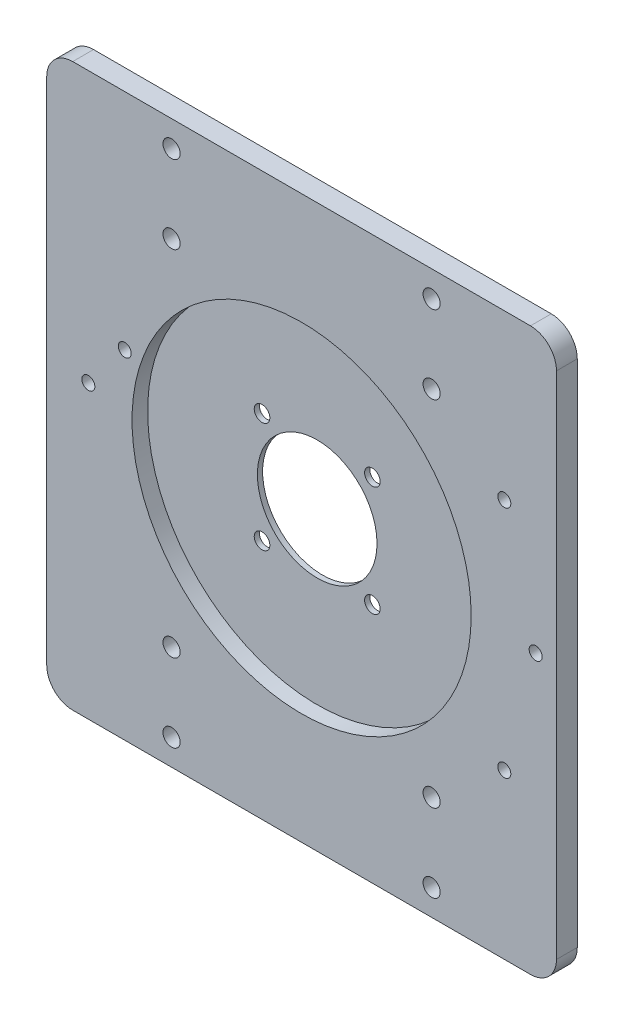
ISO-10303-21;
HEADER;
FILE_DESCRIPTION(('STEP AP214'),'2;1');
FILE_NAME('part.step','',(''),(''),'','','');
FILE_SCHEMA(('AUTOMOTIVE_DESIGN { 1 0 10303 214 1 1 1 1 }'));
ENDSEC;
DATA;
#1=APPLICATION_CONTEXT('core data for automotive mechanical design processes');
#2=APPLICATION_PROTOCOL_DEFINITION('international standard','automotive_design',2000,#1);
#3=PRODUCT_CONTEXT('',#1,'mechanical');
#4=PRODUCT('Part','Part','',(#3));
#5=PRODUCT_RELATED_PRODUCT_CATEGORY('part','',(#4));
#6=PRODUCT_DEFINITION_FORMATION('','',#4);
#7=PRODUCT_DEFINITION_CONTEXT('part definition',#1,'design');
#8=PRODUCT_DEFINITION('design','',#6,#7);
#9=PRODUCT_DEFINITION_SHAPE('','',#8);
#10=(LENGTH_UNIT() NAMED_UNIT(*) SI_UNIT(.MILLI.,.METRE.));
#11=(NAMED_UNIT(*) PLANE_ANGLE_UNIT() SI_UNIT($,.RADIAN.));
#12=(NAMED_UNIT(*) SI_UNIT($,.STERADIAN.) SOLID_ANGLE_UNIT());
#13=UNCERTAINTY_MEASURE_WITH_UNIT(LENGTH_MEASURE(1.E-05),#10,'distance_accuracy_value','');
#14=(GEOMETRIC_REPRESENTATION_CONTEXT(3) GLOBAL_UNCERTAINTY_ASSIGNED_CONTEXT((#13)) GLOBAL_UNIT_ASSIGNED_CONTEXT((#10,
#11,#12)) REPRESENTATION_CONTEXT('',''));
#15=CARTESIAN_POINT('',(0.,0.,0.));
#16=DIRECTION('',(0.,0.,1.));
#17=DIRECTION('',(1.,0.,0.));
#18=AXIS2_PLACEMENT_3D('',#15,#16,#17);
#19=CARTESIAN_POINT('',(0.,0.,-6.));
#20=DIRECTION('',(0.,0.,1.));
#21=DIRECTION('',(1.,0.,0.));
#22=AXIS2_PLACEMENT_3D('',#19,#20,#21);
#23=CYLINDRICAL_SURFACE('',#22,11.5);
#24=CARTESIAN_POINT('',(0.,0.,0.));
#25=DIRECTION('',(0.,0.,1.));
#26=DIRECTION('',(1.,0.,0.));
#27=AXIS2_PLACEMENT_3D('',#24,#25,#26);
#28=CIRCLE('',#27,11.5);
#29=CARTESIAN_POINT('',(11.5,0.,0.));
#30=VERTEX_POINT('',#29);
#31=EDGE_CURVE('E153',#30,#30,#28,.T.);
#32=ORIENTED_EDGE('',*,*,#31,.F.);
#33=EDGE_LOOP('',(#32));
#34=FACE_BOUND('',#33,.T.);
#35=CARTESIAN_POINT('',(0.,0.,1.));
#36=DIRECTION('',(0.,0.,1.));
#37=DIRECTION('',(1.,0.,0.));
#38=AXIS2_PLACEMENT_3D('',#35,#36,#37);
#39=CIRCLE('',#38,11.5);
#40=CARTESIAN_POINT('',(11.5,0.,1.));
#41=VERTEX_POINT('',#40);
#42=EDGE_CURVE('E163',#41,#41,#39,.F.);
#43=ORIENTED_EDGE('',*,*,#42,.F.);
#44=EDGE_LOOP('',(#43));
#45=FACE_BOUND('',#44,.T.);
#46=ADVANCED_FACE('F52',(#34,#45),#23,.F.);
#47=CARTESIAN_POINT('',(-49.,-54.,4.));
#48=DIRECTION('',(1.,0.,0.));
#49=DIRECTION('',(0.,0.,-1.));
#50=AXIS2_PLACEMENT_3D('',#47,#48,#49);
#51=PLANE('',#50);
#52=DIRECTION('',(0.,-1.,0.));
#53=VECTOR('',#52,1.);
#54=CARTESIAN_POINT('',(-49.,-54.,0.));
#55=LINE('',#54,#53);
#56=CARTESIAN_POINT('',(-49.,49.,0.));
#57=VERTEX_POINT('',#56);
#58=CARTESIAN_POINT('',(-49.,-49.,0.));
#59=VERTEX_POINT('',#58);
#60=EDGE_CURVE('E146',#57,#59,#55,.T.);
#61=ORIENTED_EDGE('',*,*,#60,.T.);
#62=DIRECTION('',(0.,0.,-1.));
#63=VECTOR('',#62,1.);
#64=CARTESIAN_POINT('',(-49.,-49.,4.));
#65=LINE('',#64,#63);
#66=CARTESIAN_POINT('',(-49.,-49.,4.));
#67=VERTEX_POINT('',#66);
#68=EDGE_CURVE('E124',#59,#67,#65,.F.);
#69=ORIENTED_EDGE('',*,*,#68,.T.);
#70=DIRECTION('',(0.,-1.,0.));
#71=VECTOR('',#70,1.);
#72=CARTESIAN_POINT('',(-49.,-54.,4.));
#73=LINE('',#72,#71);
#74=CARTESIAN_POINT('',(-49.,49.,4.));
#75=VERTEX_POINT('',#74);
#76=EDGE_CURVE('E159',#75,#67,#73,.T.);
#77=ORIENTED_EDGE('',*,*,#76,.F.);
#78=DIRECTION('',(0.,0.,-1.));
#79=VECTOR('',#78,1.);
#80=CARTESIAN_POINT('',(-49.,49.,4.));
#81=LINE('',#80,#79);
#82=EDGE_CURVE('E129',#75,#57,#81,.T.);
#83=ORIENTED_EDGE('',*,*,#82,.T.);
#84=EDGE_LOOP('',(#61,#69,#77,#83));
#85=FACE_BOUND('',#84,.T.);
#86=ADVANCED_FACE('F364',(#85),#51,.F.);
#87=CARTESIAN_POINT('',(49.,-54.,4.));
#88=DIRECTION('',(0.,1.,0.));
#89=DIRECTION('',(-1.,0.,0.));
#90=AXIS2_PLACEMENT_3D('',#87,#88,#89);
#91=PLANE('',#90);
#92=DIRECTION('',(1.,0.,0.));
#93=VECTOR('',#92,1.);
#94=CARTESIAN_POINT('',(49.,-54.,4.));
#95=LINE('',#94,#93);
#96=CARTESIAN_POINT('',(-44.,-54.,4.));
#97=VERTEX_POINT('',#96);
#98=CARTESIAN_POINT('',(44.,-54.,4.));
#99=VERTEX_POINT('',#98);
#100=EDGE_CURVE('E139',#97,#99,#95,.T.);
#101=ORIENTED_EDGE('',*,*,#100,.F.);
#102=DIRECTION('',(0.,0.,-1.));
#103=VECTOR('',#102,1.);
#104=CARTESIAN_POINT('',(-44.,-54.,4.));
#105=LINE('',#104,#103);
#106=CARTESIAN_POINT('',(-44.,-54.,0.));
#107=VERTEX_POINT('',#106);
#108=EDGE_CURVE('E123',#97,#107,#105,.T.);
#109=ORIENTED_EDGE('',*,*,#108,.T.);
#110=DIRECTION('',(1.,0.,0.));
#111=VECTOR('',#110,1.);
#112=CARTESIAN_POINT('',(49.,-54.,0.));
#113=LINE('',#112,#111);
#114=CARTESIAN_POINT('',(44.,-54.,0.));
#115=VERTEX_POINT('',#114);
#116=EDGE_CURVE('E136',#107,#115,#113,.T.);
#117=ORIENTED_EDGE('',*,*,#116,.T.);
#118=DIRECTION('',(0.,0.,-1.));
#119=VECTOR('',#118,1.);
#120=CARTESIAN_POINT('',(44.,-54.,4.));
#121=LINE('',#120,#119);
#122=EDGE_CURVE('E141',#115,#99,#121,.F.);
#123=ORIENTED_EDGE('',*,*,#122,.T.);
#124=EDGE_LOOP('',(#101,#109,#117,#123));
#125=FACE_BOUND('',#124,.T.);
#126=ADVANCED_FACE('F135',(#125),#91,.F.);
#127=CARTESIAN_POINT('',(49.,-54.,4.));
#128=DIRECTION('',(-1.,0.,0.));
#129=DIRECTION('',(0.,0.,1.));
#130=AXIS2_PLACEMENT_3D('',#127,#128,#129);
#131=PLANE('',#130);
#132=DIRECTION('',(0.,1.,0.));
#133=VECTOR('',#132,1.);
#134=CARTESIAN_POINT('',(49.,-54.,4.));
#135=LINE('',#134,#133);
#136=CARTESIAN_POINT('',(49.,-49.,4.));
#137=VERTEX_POINT('',#136);
#138=CARTESIAN_POINT('',(49.,49.,4.));
#139=VERTEX_POINT('',#138);
#140=EDGE_CURVE('E196',#137,#139,#135,.T.);
#141=ORIENTED_EDGE('',*,*,#140,.F.);
#142=DIRECTION('',(0.,0.,-1.));
#143=VECTOR('',#142,1.);
#144=CARTESIAN_POINT('',(49.,-49.,4.));
#145=LINE('',#144,#143);
#146=CARTESIAN_POINT('',(49.,-49.,0.));
#147=VERTEX_POINT('',#146);
#148=EDGE_CURVE('E188',#137,#147,#145,.T.);
#149=ORIENTED_EDGE('',*,*,#148,.T.);
#150=DIRECTION('',(0.,1.,0.));
#151=VECTOR('',#150,1.);
#152=CARTESIAN_POINT('',(49.,-54.,0.));
#153=LINE('',#152,#151);
#154=CARTESIAN_POINT('',(49.,49.,0.));
#155=VERTEX_POINT('',#154);
#156=EDGE_CURVE('E145',#147,#155,#153,.T.);
#157=ORIENTED_EDGE('',*,*,#156,.T.);
#158=DIRECTION('',(0.,0.,-1.));
#159=VECTOR('',#158,1.);
#160=CARTESIAN_POINT('',(49.,49.,4.));
#161=LINE('',#160,#159);
#162=EDGE_CURVE('E186',#155,#139,#161,.F.);
#163=ORIENTED_EDGE('',*,*,#162,.T.);
#164=EDGE_LOOP('',(#141,#149,#157,#163));
#165=FACE_BOUND('',#164,.T.);
#166=ADVANCED_FACE('F194',(#165),#131,.F.);
#167=CARTESIAN_POINT('',(49.,54.,4.));
#168=DIRECTION('',(0.,-1.,0.));
#169=DIRECTION('',(1.,0.,0.));
#170=AXIS2_PLACEMENT_3D('',#167,#168,#169);
#171=PLANE('',#170);
#172=DIRECTION('',(-1.,0.,0.));
#173=VECTOR('',#172,1.);
#174=CARTESIAN_POINT('',(49.,54.,4.));
#175=LINE('',#174,#173);
#176=CARTESIAN_POINT('',(44.,54.,4.));
#177=VERTEX_POINT('',#176);
#178=CARTESIAN_POINT('',(-44.,54.,4.));
#179=VERTEX_POINT('',#178);
#180=EDGE_CURVE('E168',#177,#179,#175,.T.);
#181=ORIENTED_EDGE('',*,*,#180,.F.);
#182=DIRECTION('',(0.,0.,-1.));
#183=VECTOR('',#182,1.);
#184=CARTESIAN_POINT('',(44.,54.,4.));
#185=LINE('',#184,#183);
#186=CARTESIAN_POINT('',(44.,54.,0.));
#187=VERTEX_POINT('',#186);
#188=EDGE_CURVE('E13',#177,#187,#185,.T.);
#189=ORIENTED_EDGE('',*,*,#188,.T.);
#190=DIRECTION('',(-1.,0.,0.));
#191=VECTOR('',#190,1.);
#192=CARTESIAN_POINT('',(49.,54.,0.));
#193=LINE('',#192,#191);
#194=CARTESIAN_POINT('',(-44.,54.,0.));
#195=VERTEX_POINT('',#194);
#196=EDGE_CURVE('E150',#187,#195,#193,.T.);
#197=ORIENTED_EDGE('',*,*,#196,.T.);
#198=DIRECTION('',(0.,0.,-1.));
#199=VECTOR('',#198,1.);
#200=CARTESIAN_POINT('',(-44.,54.,4.));
#201=LINE('',#200,#199);
#202=EDGE_CURVE('E61',#195,#179,#201,.F.);
#203=ORIENTED_EDGE('',*,*,#202,.T.);
#204=EDGE_LOOP('',(#181,#189,#197,#203));
#205=FACE_BOUND('',#204,.T.);
#206=ADVANCED_FACE('F203',(#205),#171,.F.);
#207=CARTESIAN_POINT('',(0.,0.,4.));
#208=DIRECTION('',(0.,0.,1.));
#209=DIRECTION('',(1.,0.,0.));
#210=AXIS2_PLACEMENT_3D('',#207,#208,#209);
#211=PLANE('',#210);
#212=CARTESIAN_POINT('',(38.9711431702997,22.5000000000001,4.));
#213=DIRECTION('',(0.,0.,1.));
#214=DIRECTION('',(1.,0.,0.));
#215=AXIS2_PLACEMENT_3D('',#212,#213,#214);
#216=CIRCLE('',#215,1.24999999999999);
#217=CARTESIAN_POINT('',(40.2211431702997,22.5000000000001,4.));
#218=VERTEX_POINT('',#217);
#219=EDGE_CURVE('E326',#218,#218,#216,.T.);
#220=ORIENTED_EDGE('',*,*,#219,.F.);
#221=EDGE_LOOP('',(#220));
#222=FACE_BOUND('',#221,.T.);
#223=CARTESIAN_POINT('',(45.,0.,4.));
#224=DIRECTION('',(0.,0.,1.));
#225=DIRECTION('',(1.,0.,0.));
#226=AXIS2_PLACEMENT_3D('',#223,#224,#225);
#227=CIRCLE('',#226,1.24999999999999);
#228=CARTESIAN_POINT('',(46.25,0.,4.));
#229=VERTEX_POINT('',#228);
#230=EDGE_CURVE('E320',#229,#229,#227,.T.);
#231=ORIENTED_EDGE('',*,*,#230,.F.);
#232=EDGE_LOOP('',(#231));
#233=FACE_BOUND('',#232,.T.);
#234=CARTESIAN_POINT('',(38.9711431702997,-22.5,4.));
#235=DIRECTION('',(0.,0.,1.));
#236=DIRECTION('',(1.,0.,0.));
#237=AXIS2_PLACEMENT_3D('',#234,#235,#236);
#238=CIRCLE('',#237,1.24999999999999);
#239=CARTESIAN_POINT('',(40.2211431702997,-22.5,4.));
#240=VERTEX_POINT('',#239);
#241=EDGE_CURVE('E314',#240,#240,#238,.T.);
#242=ORIENTED_EDGE('',*,*,#241,.F.);
#243=EDGE_LOOP('',(#242));
#244=FACE_BOUND('',#243,.T.);
#245=CARTESIAN_POINT('',(-41.0000000000006,2.00000000000001,4.));
#246=DIRECTION('',(0.,0.,1.));
#247=DIRECTION('',(1.,0.,0.));
#248=AXIS2_PLACEMENT_3D('',#245,#246,#247);
#249=CIRCLE('',#248,1.24999999999999);
#250=CARTESIAN_POINT('',(-39.7500000000007,2.00000000000001,4.));
#251=VERTEX_POINT('',#250);
#252=EDGE_CURVE('E308',#251,#251,#249,.T.);
#253=ORIENTED_EDGE('',*,*,#252,.F.);
#254=EDGE_LOOP('',(#253));
#255=FACE_BOUND('',#254,.T.);
#256=CARTESIAN_POINT('',(-34.0000000000006,11.,4.));
#257=DIRECTION('',(0.,0.,1.));
#258=DIRECTION('',(1.,0.,0.));
#259=AXIS2_PLACEMENT_3D('',#256,#257,#258);
#260=CIRCLE('',#259,1.24999999999999);
#261=CARTESIAN_POINT('',(-32.7500000000007,11.,4.));
#262=VERTEX_POINT('',#261);
#263=EDGE_CURVE('E302',#262,#262,#260,.T.);
#264=ORIENTED_EDGE('',*,*,#263,.F.);
#265=EDGE_LOOP('',(#264));
#266=FACE_BOUND('',#265,.T.);
#267=CARTESIAN_POINT('',(24.9999999999999,49.0000000000001,4.));
#268=DIRECTION('',(0.,0.,1.));
#269=DIRECTION('',(1.,0.,0.));
#270=AXIS2_PLACEMENT_3D('',#267,#268,#269);
#271=CIRCLE('',#270,1.65);
#272=CARTESIAN_POINT('',(26.6499999999999,49.0000000000001,4.));
#273=VERTEX_POINT('',#272);
#274=EDGE_CURVE('E295',#273,#273,#271,.T.);
#275=ORIENTED_EDGE('',*,*,#274,.F.);
#276=EDGE_LOOP('',(#275));
#277=FACE_BOUND('',#276,.T.);
#278=CARTESIAN_POINT('',(25.,34.0000000000001,4.));
#279=DIRECTION('',(0.,0.,1.));
#280=DIRECTION('',(1.,0.,0.));
#281=AXIS2_PLACEMENT_3D('',#278,#279,#280);
#282=CIRCLE('',#281,1.65);
#283=CARTESIAN_POINT('',(26.65,34.0000000000001,4.));
#284=VERTEX_POINT('',#283);
#285=EDGE_CURVE('E288',#284,#284,#282,.T.);
#286=ORIENTED_EDGE('',*,*,#285,.F.);
#287=EDGE_LOOP('',(#286));
#288=FACE_BOUND('',#287,.T.);
#289=CARTESIAN_POINT('',(-25.,34.,4.));
#290=DIRECTION('',(0.,0.,1.));
#291=DIRECTION('',(1.,0.,0.));
#292=AXIS2_PLACEMENT_3D('',#289,#290,#291);
#293=CIRCLE('',#292,1.65);
#294=CARTESIAN_POINT('',(-23.35,34.,4.));
#295=VERTEX_POINT('',#294);
#296=EDGE_CURVE('E282',#295,#295,#293,.T.);
#297=ORIENTED_EDGE('',*,*,#296,.F.);
#298=EDGE_LOOP('',(#297));
#299=FACE_BOUND('',#298,.T.);
#300=CARTESIAN_POINT('',(-25.0000000000001,49.,4.));
#301=DIRECTION('',(0.,0.,1.));
#302=DIRECTION('',(1.,0.,0.));
#303=AXIS2_PLACEMENT_3D('',#300,#301,#302);
#304=CIRCLE('',#303,1.65);
#305=CARTESIAN_POINT('',(-23.3500000000001,49.,4.));
#306=VERTEX_POINT('',#305);
#307=EDGE_CURVE('E276',#306,#306,#304,.T.);
#308=ORIENTED_EDGE('',*,*,#307,.F.);
#309=EDGE_LOOP('',(#308));
#310=FACE_BOUND('',#309,.T.);
#311=CARTESIAN_POINT('',(25.,-33.9999999999999,4.));
#312=DIRECTION('',(0.,0.,1.));
#313=DIRECTION('',(1.,0.,0.));
#314=AXIS2_PLACEMENT_3D('',#311,#312,#313);
#315=CIRCLE('',#314,1.65);
#316=CARTESIAN_POINT('',(26.65,-33.9999999999999,4.));
#317=VERTEX_POINT('',#316);
#318=EDGE_CURVE('E269',#317,#317,#315,.T.);
#319=ORIENTED_EDGE('',*,*,#318,.F.);
#320=EDGE_LOOP('',(#319));
#321=FACE_BOUND('',#320,.T.);
#322=CARTESIAN_POINT('',(25.,-48.9999999999999,4.));
#323=DIRECTION('',(0.,0.,1.));
#324=DIRECTION('',(1.,0.,0.));
#325=AXIS2_PLACEMENT_3D('',#322,#323,#324);
#326=CIRCLE('',#325,1.65);
#327=CARTESIAN_POINT('',(26.65,-48.9999999999999,4.));
#328=VERTEX_POINT('',#327);
#329=EDGE_CURVE('E263',#328,#328,#326,.T.);
#330=ORIENTED_EDGE('',*,*,#329,.F.);
#331=EDGE_LOOP('',(#330));
#332=FACE_BOUND('',#331,.T.);
#333=CARTESIAN_POINT('',(-24.9999999999999,-49.,4.));
#334=DIRECTION('',(0.,0.,1.));
#335=DIRECTION('',(1.,0.,0.));
#336=AXIS2_PLACEMENT_3D('',#333,#334,#335);
#337=CIRCLE('',#336,1.65);
#338=CARTESIAN_POINT('',(-23.3499999999999,-49.,4.));
#339=VERTEX_POINT('',#338);
#340=EDGE_CURVE('E256',#339,#339,#337,.T.);
#341=ORIENTED_EDGE('',*,*,#340,.F.);
#342=EDGE_LOOP('',(#341));
#343=FACE_BOUND('',#342,.T.);
#344=CARTESIAN_POINT('',(-25.,-34.,4.));
#345=DIRECTION('',(0.,0.,1.));
#346=DIRECTION('',(1.,0.,0.));
#347=AXIS2_PLACEMENT_3D('',#344,#345,#346);
#348=CIRCLE('',#347,1.65);
#349=CARTESIAN_POINT('',(-23.35,-34.,4.));
#350=VERTEX_POINT('',#349);
#351=EDGE_CURVE('E247',#350,#350,#348,.T.);
#352=ORIENTED_EDGE('',*,*,#351,.F.);
#353=EDGE_LOOP('',(#352));
#354=FACE_BOUND('',#353,.T.);
#355=CARTESIAN_POINT('',(0.,0.,4.));
#356=DIRECTION('',(0.,0.,1.));
#357=DIRECTION('',(1.,0.,0.));
#358=AXIS2_PLACEMENT_3D('',#355,#356,#357);
#359=CIRCLE('',#358,32.6);
#360=CARTESIAN_POINT('',(32.6,0.,4.));
#361=VERTEX_POINT('',#360);
#362=EDGE_CURVE('E216',#361,#361,#359,.T.);
#363=ORIENTED_EDGE('',*,*,#362,.F.);
#364=EDGE_LOOP('',(#363));
#365=FACE_BOUND('',#364,.T.);
#366=ORIENTED_EDGE('',*,*,#76,.T.);
#367=CARTESIAN_POINT('',(-44.,-49.,4.));
#368=DIRECTION('',(0.,0.,1.));
#369=DIRECTION('',(1.,0.,0.));
#370=AXIS2_PLACEMENT_3D('',#367,#368,#369);
#371=CIRCLE('',#370,5.);
#372=EDGE_CURVE('E184',#67,#97,#371,.T.);
#373=ORIENTED_EDGE('',*,*,#372,.T.);
#374=ORIENTED_EDGE('',*,*,#100,.T.);
#375=CARTESIAN_POINT('',(44.,-49.,4.));
#376=DIRECTION('',(0.,0.,1.));
#377=DIRECTION('',(1.,0.,0.));
#378=AXIS2_PLACEMENT_3D('',#375,#376,#377);
#379=CIRCLE('',#378,5.);
#380=EDGE_CURVE('E182',#99,#137,#379,.T.);
#381=ORIENTED_EDGE('',*,*,#380,.T.);
#382=ORIENTED_EDGE('',*,*,#140,.T.);
#383=CARTESIAN_POINT('',(44.,49.,4.));
#384=DIRECTION('',(0.,0.,1.));
#385=DIRECTION('',(1.,0.,0.));
#386=AXIS2_PLACEMENT_3D('',#383,#384,#385);
#387=CIRCLE('',#386,5.);
#388=EDGE_CURVE('E74',#139,#177,#387,.T.);
#389=ORIENTED_EDGE('',*,*,#388,.T.);
#390=ORIENTED_EDGE('',*,*,#180,.T.);
#391=CARTESIAN_POINT('',(-44.,49.,4.));
#392=DIRECTION('',(0.,0.,1.));
#393=DIRECTION('',(1.,0.,0.));
#394=AXIS2_PLACEMENT_3D('',#391,#392,#393);
#395=CIRCLE('',#394,5.);
#396=EDGE_CURVE('E178',#179,#75,#395,.T.);
#397=ORIENTED_EDGE('',*,*,#396,.T.);
#398=EDGE_LOOP('',(#366,#373,#374,#381,#382,#389,#390,#397));
#399=FACE_BOUND('',#398,.T.);
#400=ADVANCED_FACE('F333',(#222,#233,#244,#255,#266,#277,#288,#299,#310,#321,#332,#343,#354,
#365,#399),#211,.T.);
#401=CARTESIAN_POINT('',(0.,0.,0.));
#402=DIRECTION('',(0.,0.,1.));
#403=DIRECTION('',(1.,0.,0.));
#404=AXIS2_PLACEMENT_3D('',#401,#402,#403);
#405=PLANE('',#404);
#406=CARTESIAN_POINT('',(38.9711431702997,22.5000000000001,0.));
#407=DIRECTION('',(0.,0.,1.));
#408=DIRECTION('',(1.,0.,0.));
#409=AXIS2_PLACEMENT_3D('',#406,#407,#408);
#410=CIRCLE('',#409,1.24999999999999);
#411=CARTESIAN_POINT('',(40.2211431702997,22.5000000000001,0.));
#412=VERTEX_POINT('',#411);
#413=EDGE_CURVE('E323',#412,#412,#410,.T.);
#414=ORIENTED_EDGE('',*,*,#413,.T.);
#415=EDGE_LOOP('',(#414));
#416=FACE_BOUND('',#415,.T.);
#417=CARTESIAN_POINT('',(45.,0.,0.));
#418=DIRECTION('',(0.,0.,1.));
#419=DIRECTION('',(1.,0.,0.));
#420=AXIS2_PLACEMENT_3D('',#417,#418,#419);
#421=CIRCLE('',#420,1.24999999999999);
#422=CARTESIAN_POINT('',(46.25,0.,0.));
#423=VERTEX_POINT('',#422);
#424=EDGE_CURVE('E317',#423,#423,#421,.T.);
#425=ORIENTED_EDGE('',*,*,#424,.T.);
#426=EDGE_LOOP('',(#425));
#427=FACE_BOUND('',#426,.T.);
#428=CARTESIAN_POINT('',(38.9711431702997,-22.5,0.));
#429=DIRECTION('',(0.,0.,1.));
#430=DIRECTION('',(1.,0.,0.));
#431=AXIS2_PLACEMENT_3D('',#428,#429,#430);
#432=CIRCLE('',#431,1.24999999999999);
#433=CARTESIAN_POINT('',(40.2211431702997,-22.5,0.));
#434=VERTEX_POINT('',#433);
#435=EDGE_CURVE('E56',#434,#434,#432,.T.);
#436=ORIENTED_EDGE('',*,*,#435,.T.);
#437=EDGE_LOOP('',(#436));
#438=FACE_BOUND('',#437,.T.);
#439=CARTESIAN_POINT('',(-41.0000000000006,2.00000000000001,0.));
#440=DIRECTION('',(0.,0.,-1.));
#441=DIRECTION('',(-1.,0.,0.));
#442=AXIS2_PLACEMENT_3D('',#439,#440,#441);
#443=CIRCLE('',#442,1.24999999999999);
#444=CARTESIAN_POINT('',(-42.2500000000006,2.00000000000001,0.));
#445=VERTEX_POINT('',#444);
#446=EDGE_CURVE('E311',#445,#445,#443,.T.);
#447=ORIENTED_EDGE('',*,*,#446,.F.);
#448=EDGE_LOOP('',(#447));
#449=FACE_BOUND('',#448,.T.);
#450=CARTESIAN_POINT('',(-34.0000000000006,11.,0.));
#451=DIRECTION('',(0.,0.,-1.));
#452=DIRECTION('',(-1.,0.,0.));
#453=AXIS2_PLACEMENT_3D('',#450,#451,#452);
#454=CIRCLE('',#453,1.24999999999999);
#455=CARTESIAN_POINT('',(-35.2500000000006,11.,0.));
#456=VERTEX_POINT('',#455);
#457=EDGE_CURVE('E305',#456,#456,#454,.T.);
#458=ORIENTED_EDGE('',*,*,#457,.F.);
#459=EDGE_LOOP('',(#458));
#460=FACE_BOUND('',#459,.T.);
#461=CARTESIAN_POINT('',(24.9999999999999,49.0000000000001,0.));
#462=DIRECTION('',(0.,0.,-1.));
#463=DIRECTION('',(-1.,0.,0.));
#464=AXIS2_PLACEMENT_3D('',#461,#462,#463);
#465=CIRCLE('',#464,1.65);
#466=CARTESIAN_POINT('',(23.3499999999999,49.0000000000001,0.));
#467=VERTEX_POINT('',#466);
#468=EDGE_CURVE('E298',#467,#467,#465,.T.);
#469=ORIENTED_EDGE('',*,*,#468,.F.);
#470=EDGE_LOOP('',(#469));
#471=FACE_BOUND('',#470,.T.);
#472=CARTESIAN_POINT('',(25.,34.0000000000001,0.));
#473=DIRECTION('',(0.,0.,-1.));
#474=DIRECTION('',(-1.,0.,0.));
#475=AXIS2_PLACEMENT_3D('',#472,#473,#474);
#476=CIRCLE('',#475,1.65);
#477=CARTESIAN_POINT('',(23.35,34.0000000000001,0.));
#478=VERTEX_POINT('',#477);
#479=EDGE_CURVE('E291',#478,#478,#476,.T.);
#480=ORIENTED_EDGE('',*,*,#479,.F.);
#481=EDGE_LOOP('',(#480));
#482=FACE_BOUND('',#481,.T.);
#483=CARTESIAN_POINT('',(-25.,34.,0.));
#484=DIRECTION('',(0.,0.,-1.));
#485=DIRECTION('',(-1.,0.,0.));
#486=AXIS2_PLACEMENT_3D('',#483,#484,#485);
#487=CIRCLE('',#486,1.65);
#488=CARTESIAN_POINT('',(-26.65,34.,0.));
#489=VERTEX_POINT('',#488);
#490=EDGE_CURVE('E285',#489,#489,#487,.T.);
#491=ORIENTED_EDGE('',*,*,#490,.F.);
#492=EDGE_LOOP('',(#491));
#493=FACE_BOUND('',#492,.T.);
#494=CARTESIAN_POINT('',(-25.0000000000001,49.,0.));
#495=DIRECTION('',(0.,0.,-1.));
#496=DIRECTION('',(-1.,0.,0.));
#497=AXIS2_PLACEMENT_3D('',#494,#495,#496);
#498=CIRCLE('',#497,1.65);
#499=CARTESIAN_POINT('',(-26.6500000000001,49.,0.));
#500=VERTEX_POINT('',#499);
#501=EDGE_CURVE('E279',#500,#500,#498,.T.);
#502=ORIENTED_EDGE('',*,*,#501,.F.);
#503=EDGE_LOOP('',(#502));
#504=FACE_BOUND('',#503,.T.);
#505=CARTESIAN_POINT('',(25.,-33.9999999999999,0.));
#506=DIRECTION('',(0.,0.,-1.));
#507=DIRECTION('',(-1.,0.,0.));
#508=AXIS2_PLACEMENT_3D('',#505,#506,#507);
#509=CIRCLE('',#508,1.65);
#510=CARTESIAN_POINT('',(23.35,-33.9999999999999,0.));
#511=VERTEX_POINT('',#510);
#512=EDGE_CURVE('E272',#511,#511,#509,.T.);
#513=ORIENTED_EDGE('',*,*,#512,.F.);
#514=EDGE_LOOP('',(#513));
#515=FACE_BOUND('',#514,.T.);
#516=CARTESIAN_POINT('',(25.,-48.9999999999999,0.));
#517=DIRECTION('',(0.,0.,-1.));
#518=DIRECTION('',(-1.,0.,0.));
#519=AXIS2_PLACEMENT_3D('',#516,#517,#518);
#520=CIRCLE('',#519,1.65);
#521=CARTESIAN_POINT('',(23.35,-48.9999999999999,0.));
#522=VERTEX_POINT('',#521);
#523=EDGE_CURVE('E266',#522,#522,#520,.T.);
#524=ORIENTED_EDGE('',*,*,#523,.F.);
#525=EDGE_LOOP('',(#524));
#526=FACE_BOUND('',#525,.T.);
#527=CARTESIAN_POINT('',(-24.9999999999999,-49.,0.));
#528=DIRECTION('',(0.,0.,-1.));
#529=DIRECTION('',(-1.,0.,0.));
#530=AXIS2_PLACEMENT_3D('',#527,#528,#529);
#531=CIRCLE('',#530,1.65);
#532=CARTESIAN_POINT('',(-26.6499999999999,-49.,0.));
#533=VERTEX_POINT('',#532);
#534=EDGE_CURVE('E259',#533,#533,#531,.T.);
#535=ORIENTED_EDGE('',*,*,#534,.F.);
#536=EDGE_LOOP('',(#535));
#537=FACE_BOUND('',#536,.T.);
#538=CARTESIAN_POINT('',(-25.,-34.,0.));
#539=DIRECTION('',(0.,0.,-1.));
#540=DIRECTION('',(-1.,0.,0.));
#541=AXIS2_PLACEMENT_3D('',#538,#539,#540);
#542=CIRCLE('',#541,1.65);
#543=CARTESIAN_POINT('',(-26.65,-34.,0.));
#544=VERTEX_POINT('',#543);
#545=EDGE_CURVE('E252',#544,#544,#542,.T.);
#546=ORIENTED_EDGE('',*,*,#545,.F.);
#547=EDGE_LOOP('',(#546));
#548=FACE_BOUND('',#547,.T.);
#549=CARTESIAN_POINT('',(-10.6066017177981,-10.6066017177983,0.));
#550=DIRECTION('',(0.,0.,1.));
#551=DIRECTION('',(1.,0.,0.));
#552=AXIS2_PLACEMENT_3D('',#549,#550,#551);
#553=CIRCLE('',#552,1.5);
#554=CARTESIAN_POINT('',(-9.10660171779812,-10.6066017177983,0.));
#555=VERTEX_POINT('',#554);
#556=EDGE_CURVE('E230',#555,#555,#553,.T.);
#557=ORIENTED_EDGE('',*,*,#556,.T.);
#558=EDGE_LOOP('',(#557));
#559=FACE_BOUND('',#558,.T.);
#560=CARTESIAN_POINT('',(10.6066017177982,10.6066017177982,0.));
#561=DIRECTION('',(0.,0.,1.));
#562=DIRECTION('',(1.,0.,0.));
#563=AXIS2_PLACEMENT_3D('',#560,#561,#562);
#564=CIRCLE('',#563,1.5);
#565=CARTESIAN_POINT('',(12.1066017177982,10.6066017177982,0.));
#566=VERTEX_POINT('',#565);
#567=EDGE_CURVE('E234',#566,#566,#564,.T.);
#568=ORIENTED_EDGE('',*,*,#567,.T.);
#569=EDGE_LOOP('',(#568));
#570=FACE_BOUND('',#569,.T.);
#571=CARTESIAN_POINT('',(-10.6066017177983,10.6066017177982,0.));
#572=DIRECTION('',(0.,0.,1.));
#573=DIRECTION('',(1.,0.,0.));
#574=AXIS2_PLACEMENT_3D('',#571,#572,#573);
#575=CIRCLE('',#574,1.5);
#576=CARTESIAN_POINT('',(-9.10660171779828,10.6066017177982,0.));
#577=VERTEX_POINT('',#576);
#578=EDGE_CURVE('E237',#577,#577,#575,.T.);
#579=ORIENTED_EDGE('',*,*,#578,.T.);
#580=EDGE_LOOP('',(#579));
#581=FACE_BOUND('',#580,.T.);
#582=CARTESIAN_POINT('',(10.6066017177983,-10.6066017177981,0.));
#583=DIRECTION('',(0.,0.,1.));
#584=DIRECTION('',(1.,0.,0.));
#585=AXIS2_PLACEMENT_3D('',#582,#583,#584);
#586=CIRCLE('',#585,1.5);
#587=CARTESIAN_POINT('',(12.1066017177983,-10.6066017177981,0.));
#588=VERTEX_POINT('',#587);
#589=EDGE_CURVE('E220',#588,#588,#586,.T.);
#590=ORIENTED_EDGE('',*,*,#589,.T.);
#591=EDGE_LOOP('',(#590));
#592=FACE_BOUND('',#591,.T.);
#593=ORIENTED_EDGE('',*,*,#31,.T.);
#594=EDGE_LOOP('',(#593));
#595=FACE_BOUND('',#594,.T.);
#596=ORIENTED_EDGE('',*,*,#116,.F.);
#597=CARTESIAN_POINT('',(-44.,-49.,0.));
#598=DIRECTION('',(0.,0.,1.));
#599=DIRECTION('',(1.,0.,0.));
#600=AXIS2_PLACEMENT_3D('',#597,#598,#599);
#601=CIRCLE('',#600,5.);
#602=EDGE_CURVE('E119',#107,#59,#601,.F.);
#603=ORIENTED_EDGE('',*,*,#602,.T.);
#604=ORIENTED_EDGE('',*,*,#60,.F.);
#605=CARTESIAN_POINT('',(-44.,49.,0.));
#606=DIRECTION('',(0.,0.,1.));
#607=DIRECTION('',(1.,0.,0.));
#608=AXIS2_PLACEMENT_3D('',#605,#606,#607);
#609=CIRCLE('',#608,5.);
#610=EDGE_CURVE('E140',#57,#195,#609,.F.);
#611=ORIENTED_EDGE('',*,*,#610,.T.);
#612=ORIENTED_EDGE('',*,*,#196,.F.);
#613=CARTESIAN_POINT('',(44.,49.,0.));
#614=DIRECTION('',(0.,0.,1.));
#615=DIRECTION('',(1.,0.,0.));
#616=AXIS2_PLACEMENT_3D('',#613,#614,#615);
#617=CIRCLE('',#616,5.);
#618=EDGE_CURVE('E172',#187,#155,#617,.F.);
#619=ORIENTED_EDGE('',*,*,#618,.T.);
#620=ORIENTED_EDGE('',*,*,#156,.F.);
#621=CARTESIAN_POINT('',(44.,-49.,0.));
#622=DIRECTION('',(0.,0.,1.));
#623=DIRECTION('',(1.,0.,0.));
#624=AXIS2_PLACEMENT_3D('',#621,#622,#623);
#625=CIRCLE('',#624,5.);
#626=EDGE_CURVE('E130',#147,#115,#625,.F.);
#627=ORIENTED_EDGE('',*,*,#626,.T.);
#628=EDGE_LOOP('',(#596,#603,#604,#611,#612,#619,#620,#627));
#629=FACE_BOUND('',#628,.T.);
#630=ADVANCED_FACE('F143',(#416,#427,#438,#449,#460,#471,#482,#493,#504,#515,#526,#537,#548,
#559,#570,#581,#592,#595,#629),#405,.F.);
#631=CARTESIAN_POINT('',(0.,0.,1.));
#632=DIRECTION('',(0.,0.,1.));
#633=DIRECTION('',(1.,0.,0.));
#634=AXIS2_PLACEMENT_3D('',#631,#632,#633);
#635=PLANE('',#634);
#636=CARTESIAN_POINT('',(-10.6066017177981,-10.6066017177983,1.));
#637=DIRECTION('',(0.,0.,1.));
#638=DIRECTION('',(1.,0.,0.));
#639=AXIS2_PLACEMENT_3D('',#636,#637,#638);
#640=CIRCLE('',#639,1.5);
#641=CARTESIAN_POINT('',(-9.10660171779812,-10.6066017177983,1.));
#642=VERTEX_POINT('',#641);
#643=EDGE_CURVE('E244',#642,#642,#640,.T.);
#644=ORIENTED_EDGE('',*,*,#643,.F.);
#645=EDGE_LOOP('',(#644));
#646=FACE_BOUND('',#645,.T.);
#647=CARTESIAN_POINT('',(10.6066017177982,10.6066017177982,1.));
#648=DIRECTION('',(0.,0.,1.));
#649=DIRECTION('',(1.,0.,0.));
#650=AXIS2_PLACEMENT_3D('',#647,#648,#649);
#651=CIRCLE('',#650,1.5);
#652=CARTESIAN_POINT('',(12.1066017177982,10.6066017177982,1.));
#653=VERTEX_POINT('',#652);
#654=EDGE_CURVE('E243',#653,#653,#651,.T.);
#655=ORIENTED_EDGE('',*,*,#654,.F.);
#656=EDGE_LOOP('',(#655));
#657=FACE_BOUND('',#656,.T.);
#658=CARTESIAN_POINT('',(-10.6066017177983,10.6066017177982,1.));
#659=DIRECTION('',(0.,0.,1.));
#660=DIRECTION('',(1.,0.,0.));
#661=AXIS2_PLACEMENT_3D('',#658,#659,#660);
#662=CIRCLE('',#661,1.5);
#663=CARTESIAN_POINT('',(-9.10660171779828,10.6066017177982,1.));
#664=VERTEX_POINT('',#663);
#665=EDGE_CURVE('E240',#664,#664,#662,.T.);
#666=ORIENTED_EDGE('',*,*,#665,.F.);
#667=EDGE_LOOP('',(#666));
#668=FACE_BOUND('',#667,.T.);
#669=CARTESIAN_POINT('',(10.6066017177983,-10.6066017177981,1.));
#670=DIRECTION('',(0.,0.,1.));
#671=DIRECTION('',(1.,0.,0.));
#672=AXIS2_PLACEMENT_3D('',#669,#670,#671);
#673=CIRCLE('',#672,1.5);
#674=CARTESIAN_POINT('',(12.1066017177983,-10.6066017177981,1.));
#675=VERTEX_POINT('',#674);
#676=EDGE_CURVE('E226',#675,#675,#673,.T.);
#677=ORIENTED_EDGE('',*,*,#676,.F.);
#678=EDGE_LOOP('',(#677));
#679=FACE_BOUND('',#678,.T.);
#680=CARTESIAN_POINT('',(0.,0.,1.));
#681=DIRECTION('',(0.,0.,1.));
#682=DIRECTION('',(1.,0.,0.));
#683=AXIS2_PLACEMENT_3D('',#680,#681,#682);
#684=CIRCLE('',#683,32.6);
#685=CARTESIAN_POINT('',(32.6,0.,1.));
#686=VERTEX_POINT('',#685);
#687=EDGE_CURVE('E167',#686,#686,#684,.T.);
#688=ORIENTED_EDGE('',*,*,#687,.T.);
#689=EDGE_LOOP('',(#688));
#690=FACE_BOUND('',#689,.T.);
#691=ORIENTED_EDGE('',*,*,#42,.T.);
#692=EDGE_LOOP('',(#691));
#693=FACE_BOUND('',#692,.T.);
#694=ADVANCED_FACE('F393',(#646,#657,#668,#679,#690,#693),#635,.T.);
#695=CARTESIAN_POINT('',(0.,0.,1.));
#696=DIRECTION('',(0.,0.,1.));
#697=DIRECTION('',(1.,0.,0.));
#698=AXIS2_PLACEMENT_3D('',#695,#696,#697);
#699=CYLINDRICAL_SURFACE('',#698,32.6);
#700=ORIENTED_EDGE('',*,*,#687,.F.);
#701=EDGE_LOOP('',(#700));
#702=FACE_BOUND('',#701,.T.);
#703=ORIENTED_EDGE('',*,*,#362,.T.);
#704=EDGE_LOOP('',(#703));
#705=FACE_BOUND('',#704,.T.);
#706=ADVANCED_FACE('F388',(#702,#705),#699,.F.);
#707=CARTESIAN_POINT('',(10.6066017177983,-10.6066017177981,-1.));
#708=DIRECTION('',(0.,0.,1.));
#709=DIRECTION('',(1.,0.,0.));
#710=AXIS2_PLACEMENT_3D('',#707,#708,#709);
#711=CYLINDRICAL_SURFACE('',#710,1.5);
#712=ORIENTED_EDGE('',*,*,#676,.T.);
#713=EDGE_LOOP('',(#712));
#714=FACE_BOUND('',#713,.T.);
#715=ORIENTED_EDGE('',*,*,#589,.F.);
#716=EDGE_LOOP('',(#715));
#717=FACE_BOUND('',#716,.T.);
#718=ADVANCED_FACE('F600',(#714,#717),#711,.F.);
#719=CARTESIAN_POINT('',(-10.6066017177983,10.6066017177982,-1.));
#720=DIRECTION('',(0.,0.,1.));
#721=DIRECTION('',(1.,0.,0.));
#722=AXIS2_PLACEMENT_3D('',#719,#720,#721);
#723=CYLINDRICAL_SURFACE('',#722,1.5);
#724=ORIENTED_EDGE('',*,*,#665,.T.);
#725=EDGE_LOOP('',(#724));
#726=FACE_BOUND('',#725,.T.);
#727=ORIENTED_EDGE('',*,*,#578,.F.);
#728=EDGE_LOOP('',(#727));
#729=FACE_BOUND('',#728,.T.);
#730=ADVANCED_FACE('F426',(#726,#729),#723,.F.);
#731=CARTESIAN_POINT('',(10.6066017177982,10.6066017177982,-1.));
#732=DIRECTION('',(0.,0.,1.));
#733=DIRECTION('',(1.,0.,0.));
#734=AXIS2_PLACEMENT_3D('',#731,#732,#733);
#735=CYLINDRICAL_SURFACE('',#734,1.5);
#736=ORIENTED_EDGE('',*,*,#654,.T.);
#737=EDGE_LOOP('',(#736));
#738=FACE_BOUND('',#737,.T.);
#739=ORIENTED_EDGE('',*,*,#567,.F.);
#740=EDGE_LOOP('',(#739));
#741=FACE_BOUND('',#740,.T.);
#742=ADVANCED_FACE('F422',(#738,#741),#735,.F.);
#743=CARTESIAN_POINT('',(-10.6066017177981,-10.6066017177983,-1.));
#744=DIRECTION('',(0.,0.,1.));
#745=DIRECTION('',(1.,0.,0.));
#746=AXIS2_PLACEMENT_3D('',#743,#744,#745);
#747=CYLINDRICAL_SURFACE('',#746,1.5);
#748=ORIENTED_EDGE('',*,*,#643,.T.);
#749=EDGE_LOOP('',(#748));
#750=FACE_BOUND('',#749,.T.);
#751=ORIENTED_EDGE('',*,*,#556,.F.);
#752=EDGE_LOOP('',(#751));
#753=FACE_BOUND('',#752,.T.);
#754=ADVANCED_FACE('F403',(#750,#753),#747,.F.);
#755=CARTESIAN_POINT('',(-44.,-49.,4.));
#756=DIRECTION('',(0.,0.,-1.));
#757=DIRECTION('',(-1.,0.,0.));
#758=AXIS2_PLACEMENT_3D('',#755,#756,#757);
#759=CYLINDRICAL_SURFACE('',#758,5.);
#760=ORIENTED_EDGE('',*,*,#372,.F.);
#761=ORIENTED_EDGE('',*,*,#68,.F.);
#762=ORIENTED_EDGE('',*,*,#602,.F.);
#763=ORIENTED_EDGE('',*,*,#108,.F.);
#764=EDGE_LOOP('',(#760,#761,#762,#763));
#765=FACE_BOUND('',#764,.T.);
#766=ADVANCED_FACE('F122',(#765),#759,.T.);
#767=CARTESIAN_POINT('',(44.,-49.,4.));
#768=DIRECTION('',(0.,0.,-1.));
#769=DIRECTION('',(-1.,0.,0.));
#770=AXIS2_PLACEMENT_3D('',#767,#768,#769);
#771=CYLINDRICAL_SURFACE('',#770,5.);
#772=ORIENTED_EDGE('',*,*,#380,.F.);
#773=ORIENTED_EDGE('',*,*,#122,.F.);
#774=ORIENTED_EDGE('',*,*,#626,.F.);
#775=ORIENTED_EDGE('',*,*,#148,.F.);
#776=EDGE_LOOP('',(#772,#773,#774,#775));
#777=FACE_BOUND('',#776,.T.);
#778=ADVANCED_FACE('F375',(#777),#771,.T.);
#779=CARTESIAN_POINT('',(44.,49.,4.));
#780=DIRECTION('',(0.,0.,-1.));
#781=DIRECTION('',(-1.,0.,0.));
#782=AXIS2_PLACEMENT_3D('',#779,#780,#781);
#783=CYLINDRICAL_SURFACE('',#782,5.);
#784=ORIENTED_EDGE('',*,*,#388,.F.);
#785=ORIENTED_EDGE('',*,*,#162,.F.);
#786=ORIENTED_EDGE('',*,*,#618,.F.);
#787=ORIENTED_EDGE('',*,*,#188,.F.);
#788=EDGE_LOOP('',(#784,#785,#786,#787));
#789=FACE_BOUND('',#788,.T.);
#790=ADVANCED_FACE('F202',(#789),#783,.T.);
#791=CARTESIAN_POINT('',(-44.,49.,4.));
#792=DIRECTION('',(0.,0.,-1.));
#793=DIRECTION('',(-1.,0.,0.));
#794=AXIS2_PLACEMENT_3D('',#791,#792,#793);
#795=CYLINDRICAL_SURFACE('',#794,5.);
#796=ORIENTED_EDGE('',*,*,#396,.F.);
#797=ORIENTED_EDGE('',*,*,#202,.F.);
#798=ORIENTED_EDGE('',*,*,#610,.F.);
#799=ORIENTED_EDGE('',*,*,#82,.F.);
#800=EDGE_LOOP('',(#796,#797,#798,#799));
#801=FACE_BOUND('',#800,.T.);
#802=ADVANCED_FACE('F54',(#801),#795,.T.);
#803=CARTESIAN_POINT('',(-25.,-34.,0.));
#804=DIRECTION('',(0.,0.,-1.));
#805=DIRECTION('',(-1.,0.,0.));
#806=AXIS2_PLACEMENT_3D('',#803,#804,#805);
#807=CYLINDRICAL_SURFACE('',#806,1.65);
#808=ORIENTED_EDGE('',*,*,#351,.T.);
#809=EDGE_LOOP('',(#808));
#810=FACE_BOUND('',#809,.T.);
#811=ORIENTED_EDGE('',*,*,#545,.T.);
#812=EDGE_LOOP('',(#811));
#813=FACE_BOUND('',#812,.T.);
#814=ADVANCED_FACE('F367',(#810,#813),#807,.F.);
#815=CARTESIAN_POINT('',(-24.9999999999999,-49.,0.));
#816=DIRECTION('',(0.,0.,-1.));
#817=DIRECTION('',(-1.,0.,0.));
#818=AXIS2_PLACEMENT_3D('',#815,#816,#817);
#819=CYLINDRICAL_SURFACE('',#818,1.65);
#820=ORIENTED_EDGE('',*,*,#340,.T.);
#821=EDGE_LOOP('',(#820));
#822=FACE_BOUND('',#821,.T.);
#823=ORIENTED_EDGE('',*,*,#534,.T.);
#824=EDGE_LOOP('',(#823));
#825=FACE_BOUND('',#824,.T.);
#826=ADVANCED_FACE('F372',(#822,#825),#819,.F.);
#827=CARTESIAN_POINT('',(25.,-48.9999999999999,0.));
#828=DIRECTION('',(0.,0.,-1.));
#829=DIRECTION('',(-1.,0.,0.));
#830=AXIS2_PLACEMENT_3D('',#827,#828,#829);
#831=CYLINDRICAL_SURFACE('',#830,1.65);
#832=ORIENTED_EDGE('',*,*,#329,.T.);
#833=EDGE_LOOP('',(#832));
#834=FACE_BOUND('',#833,.T.);
#835=ORIENTED_EDGE('',*,*,#523,.T.);
#836=EDGE_LOOP('',(#835));
#837=FACE_BOUND('',#836,.T.);
#838=ADVANCED_FACE('F461',(#834,#837),#831,.F.);
#839=CARTESIAN_POINT('',(25.,-33.9999999999999,0.));
#840=DIRECTION('',(0.,0.,-1.));
#841=DIRECTION('',(-1.,0.,0.));
#842=AXIS2_PLACEMENT_3D('',#839,#840,#841);
#843=CYLINDRICAL_SURFACE('',#842,1.65);
#844=ORIENTED_EDGE('',*,*,#318,.T.);
#845=EDGE_LOOP('',(#844));
#846=FACE_BOUND('',#845,.T.);
#847=ORIENTED_EDGE('',*,*,#512,.T.);
#848=EDGE_LOOP('',(#847));
#849=FACE_BOUND('',#848,.T.);
#850=ADVANCED_FACE('F456',(#846,#849),#843,.F.);
#851=CARTESIAN_POINT('',(-25.0000000000001,49.,0.));
#852=DIRECTION('',(0.,0.,-1.));
#853=DIRECTION('',(-1.,0.,0.));
#854=AXIS2_PLACEMENT_3D('',#851,#852,#853);
#855=CYLINDRICAL_SURFACE('',#854,1.65);
#856=ORIENTED_EDGE('',*,*,#307,.T.);
#857=EDGE_LOOP('',(#856));
#858=FACE_BOUND('',#857,.T.);
#859=ORIENTED_EDGE('',*,*,#501,.T.);
#860=EDGE_LOOP('',(#859));
#861=FACE_BOUND('',#860,.T.);
#862=ADVANCED_FACE('F460',(#858,#861),#855,.F.);
#863=CARTESIAN_POINT('',(-25.,34.,0.));
#864=DIRECTION('',(0.,0.,-1.));
#865=DIRECTION('',(-1.,0.,0.));
#866=AXIS2_PLACEMENT_3D('',#863,#864,#865);
#867=CYLINDRICAL_SURFACE('',#866,1.65);
#868=ORIENTED_EDGE('',*,*,#296,.T.);
#869=EDGE_LOOP('',(#868));
#870=FACE_BOUND('',#869,.T.);
#871=ORIENTED_EDGE('',*,*,#490,.T.);
#872=EDGE_LOOP('',(#871));
#873=FACE_BOUND('',#872,.T.);
#874=ADVANCED_FACE('F660',(#870,#873),#867,.F.);
#875=CARTESIAN_POINT('',(25.,34.0000000000001,0.));
#876=DIRECTION('',(0.,0.,-1.));
#877=DIRECTION('',(-1.,0.,0.));
#878=AXIS2_PLACEMENT_3D('',#875,#876,#877);
#879=CYLINDRICAL_SURFACE('',#878,1.65);
#880=ORIENTED_EDGE('',*,*,#285,.T.);
#881=EDGE_LOOP('',(#880));
#882=FACE_BOUND('',#881,.T.);
#883=ORIENTED_EDGE('',*,*,#479,.T.);
#884=EDGE_LOOP('',(#883));
#885=FACE_BOUND('',#884,.T.);
#886=ADVANCED_FACE('F669',(#882,#885),#879,.F.);
#887=CARTESIAN_POINT('',(24.9999999999999,49.0000000000001,0.));
#888=DIRECTION('',(0.,0.,-1.));
#889=DIRECTION('',(-1.,0.,0.));
#890=AXIS2_PLACEMENT_3D('',#887,#888,#889);
#891=CYLINDRICAL_SURFACE('',#890,1.65);
#892=ORIENTED_EDGE('',*,*,#274,.T.);
#893=EDGE_LOOP('',(#892));
#894=FACE_BOUND('',#893,.T.);
#895=ORIENTED_EDGE('',*,*,#468,.T.);
#896=EDGE_LOOP('',(#895));
#897=FACE_BOUND('',#896,.T.);
#898=ADVANCED_FACE('F527',(#894,#897),#891,.F.);
#899=CARTESIAN_POINT('',(-34.0000000000006,11.,0.));
#900=DIRECTION('',(0.,0.,-1.));
#901=DIRECTION('',(-1.,0.,0.));
#902=AXIS2_PLACEMENT_3D('',#899,#900,#901);
#903=CYLINDRICAL_SURFACE('',#902,1.24999999999999);
#904=ORIENTED_EDGE('',*,*,#263,.T.);
#905=EDGE_LOOP('',(#904));
#906=FACE_BOUND('',#905,.T.);
#907=ORIENTED_EDGE('',*,*,#457,.T.);
#908=EDGE_LOOP('',(#907));
#909=FACE_BOUND('',#908,.T.);
#910=ADVANCED_FACE('F524',(#906,#909),#903,.F.);
#911=CARTESIAN_POINT('',(-41.0000000000006,2.00000000000001,0.));
#912=DIRECTION('',(0.,0.,-1.));
#913=DIRECTION('',(-1.,0.,0.));
#914=AXIS2_PLACEMENT_3D('',#911,#912,#913);
#915=CYLINDRICAL_SURFACE('',#914,1.24999999999999);
#916=ORIENTED_EDGE('',*,*,#252,.T.);
#917=EDGE_LOOP('',(#916));
#918=FACE_BOUND('',#917,.T.);
#919=ORIENTED_EDGE('',*,*,#446,.T.);
#920=EDGE_LOOP('',(#919));
#921=FACE_BOUND('',#920,.T.);
#922=ADVANCED_FACE('F481',(#918,#921),#915,.F.);
#923=CARTESIAN_POINT('',(38.9711431702997,-22.5,4.));
#924=DIRECTION('',(0.,0.,1.));
#925=DIRECTION('',(1.,0.,0.));
#926=AXIS2_PLACEMENT_3D('',#923,#924,#925);
#927=CYLINDRICAL_SURFACE('',#926,1.24999999999999);
#928=ORIENTED_EDGE('',*,*,#241,.T.);
#929=EDGE_LOOP('',(#928));
#930=FACE_BOUND('',#929,.T.);
#931=ORIENTED_EDGE('',*,*,#435,.F.);
#932=EDGE_LOOP('',(#931));
#933=FACE_BOUND('',#932,.T.);
#934=ADVANCED_FACE('F490',(#930,#933),#927,.F.);
#935=CARTESIAN_POINT('',(45.,0.,4.));
#936=DIRECTION('',(0.,0.,1.));
#937=DIRECTION('',(1.,0.,0.));
#938=AXIS2_PLACEMENT_3D('',#935,#936,#937);
#939=CYLINDRICAL_SURFACE('',#938,1.24999999999999);
#940=ORIENTED_EDGE('',*,*,#230,.T.);
#941=EDGE_LOOP('',(#940));
#942=FACE_BOUND('',#941,.T.);
#943=ORIENTED_EDGE('',*,*,#424,.F.);
#944=EDGE_LOOP('',(#943));
#945=FACE_BOUND('',#944,.T.);
#946=ADVANCED_FACE('F496',(#942,#945),#939,.F.);
#947=CARTESIAN_POINT('',(38.9711431702997,22.5000000000001,4.));
#948=DIRECTION('',(0.,0.,1.));
#949=DIRECTION('',(1.,0.,0.));
#950=AXIS2_PLACEMENT_3D('',#947,#948,#949);
#951=CYLINDRICAL_SURFACE('',#950,1.24999999999999);
#952=ORIENTED_EDGE('',*,*,#219,.T.);
#953=EDGE_LOOP('',(#952));
#954=FACE_BOUND('',#953,.T.);
#955=ORIENTED_EDGE('',*,*,#413,.F.);
#956=EDGE_LOOP('',(#955));
#957=FACE_BOUND('',#956,.T.);
#958=ADVANCED_FACE('F330',(#954,#957),#951,.F.);
#959=CLOSED_SHELL('',(#46,#86,#126,#166,#206,#400,#630,#694,#706,#718,#730,#742,#754,#766,#778,
#790,#802,#814,#826,#838,#850,#862,#874,#886,#898,#910,#922,#934,#946,#958));
#960=MANIFOLD_SOLID_BREP('B2',#959);
#961=ADVANCED_BREP_SHAPE_REPRESENTATION('',(#18,#960),#14);
#962=SHAPE_DEFINITION_REPRESENTATION(#9,#961);
ENDSEC;
END-ISO-10303-21;
